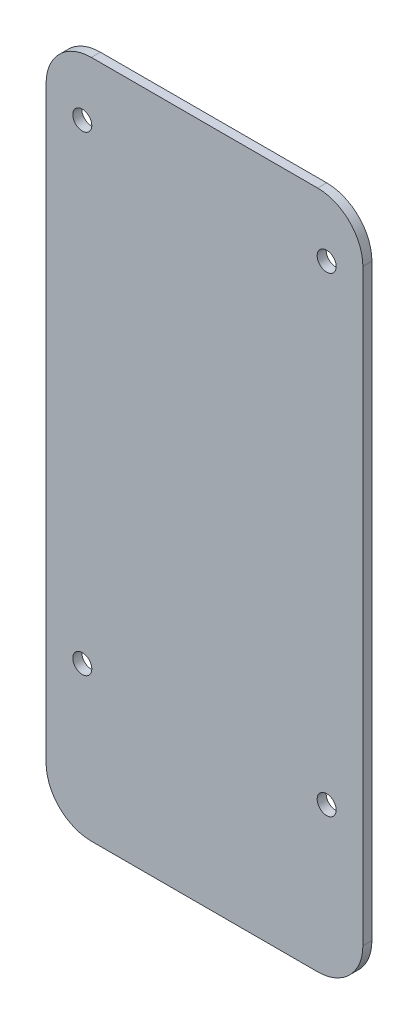
ISO-10303-21;
HEADER;
FILE_DESCRIPTION(('STEP AP214'),'2;1');
FILE_NAME('part.step','',(''),(''),'','','');
FILE_SCHEMA(('AUTOMOTIVE_DESIGN { 1 0 10303 214 1 1 1 1 }'));
ENDSEC;
DATA;
#1=APPLICATION_CONTEXT('core data for automotive mechanical design processes');
#2=APPLICATION_PROTOCOL_DEFINITION('international standard','automotive_design',2000,#1);
#3=PRODUCT_CONTEXT('',#1,'mechanical');
#4=PRODUCT('Part','Part','',(#3));
#5=PRODUCT_RELATED_PRODUCT_CATEGORY('part','',(#4));
#6=PRODUCT_DEFINITION_FORMATION('','',#4);
#7=PRODUCT_DEFINITION_CONTEXT('part definition',#1,'design');
#8=PRODUCT_DEFINITION('design','',#6,#7);
#9=PRODUCT_DEFINITION_SHAPE('','',#8);
#10=(LENGTH_UNIT() NAMED_UNIT(*) SI_UNIT(.MILLI.,.METRE.));
#11=(NAMED_UNIT(*) PLANE_ANGLE_UNIT() SI_UNIT($,.RADIAN.));
#12=(NAMED_UNIT(*) SI_UNIT($,.STERADIAN.) SOLID_ANGLE_UNIT());
#13=UNCERTAINTY_MEASURE_WITH_UNIT(LENGTH_MEASURE(1.E-05),#10,'distance_accuracy_value','');
#14=(GEOMETRIC_REPRESENTATION_CONTEXT(3) GLOBAL_UNCERTAINTY_ASSIGNED_CONTEXT((#13)) GLOBAL_UNIT_ASSIGNED_CONTEXT((#10,
#11,#12)) REPRESENTATION_CONTEXT('',''));
#15=CARTESIAN_POINT('',(0.,0.,0.));
#16=DIRECTION('',(0.,0.,1.));
#17=DIRECTION('',(1.,0.,0.));
#18=AXIS2_PLACEMENT_3D('',#15,#16,#17);
#19=CARTESIAN_POINT('',(0.,0.,2.));
#20=DIRECTION('',(0.,0.,1.));
#21=DIRECTION('',(1.,0.,0.));
#22=AXIS2_PLACEMENT_3D('',#19,#20,#21);
#23=PLANE('',#22);
#24=CARTESIAN_POINT('',(27.,-42.,2.));
#25=DIRECTION('',(0.,0.,1.));
#26=DIRECTION('',(1.,0.,0.));
#27=AXIS2_PLACEMENT_3D('',#24,#25,#26);
#28=CIRCLE('',#27,2.1);
#29=CARTESIAN_POINT('',(29.1,-42.,2.));
#30=VERTEX_POINT('',#29);
#31=EDGE_CURVE('E192',#30,#30,#28,.T.);
#32=ORIENTED_EDGE('',*,*,#31,.F.);
#33=EDGE_LOOP('',(#32));
#34=FACE_BOUND('',#33,.T.);
#35=CARTESIAN_POINT('',(-27.,62.,2.));
#36=DIRECTION('',(0.,0.,1.));
#37=DIRECTION('',(1.,0.,0.));
#38=AXIS2_PLACEMENT_3D('',#35,#36,#37);
#39=CIRCLE('',#38,2.1);
#40=CARTESIAN_POINT('',(-24.9,62.,2.));
#41=VERTEX_POINT('',#40);
#42=EDGE_CURVE('E133',#41,#41,#39,.T.);
#43=ORIENTED_EDGE('',*,*,#42,.F.);
#44=EDGE_LOOP('',(#43));
#45=FACE_BOUND('',#44,.T.);
#46=DIRECTION('',(1.,0.,0.));
#47=VECTOR('',#46,1.);
#48=CARTESIAN_POINT('',(-35.,-75.,2.));
#49=LINE('',#48,#47);
#50=CARTESIAN_POINT('',(-25.,-75.,2.));
#51=VERTEX_POINT('',#50);
#52=CARTESIAN_POINT('',(25.,-75.,2.));
#53=VERTEX_POINT('',#52);
#54=EDGE_CURVE('E142',#51,#53,#49,.T.);
#55=ORIENTED_EDGE('',*,*,#54,.T.);
#56=CARTESIAN_POINT('',(25.,-65.,2.));
#57=DIRECTION('',(0.,0.,1.));
#58=DIRECTION('',(1.,0.,0.));
#59=AXIS2_PLACEMENT_3D('',#56,#57,#58);
#60=CIRCLE('',#59,10.);
#61=CARTESIAN_POINT('',(35.,-65.,2.));
#62=VERTEX_POINT('',#61);
#63=EDGE_CURVE('E161',#53,#62,#60,.T.);
#64=ORIENTED_EDGE('',*,*,#63,.T.);
#65=DIRECTION('',(0.,1.,0.));
#66=VECTOR('',#65,1.);
#67=CARTESIAN_POINT('',(35.,75.,2.));
#68=LINE('',#67,#66);
#69=CARTESIAN_POINT('',(35.,65.,2.));
#70=VERTEX_POINT('',#69);
#71=EDGE_CURVE('E125',#62,#70,#68,.T.);
#72=ORIENTED_EDGE('',*,*,#71,.T.);
#73=CARTESIAN_POINT('',(25.,65.,2.));
#74=DIRECTION('',(0.,0.,1.));
#75=DIRECTION('',(1.,0.,0.));
#76=AXIS2_PLACEMENT_3D('',#73,#74,#75);
#77=CIRCLE('',#76,10.);
#78=CARTESIAN_POINT('',(25.,75.,2.));
#79=VERTEX_POINT('',#78);
#80=EDGE_CURVE('E156',#70,#79,#77,.T.);
#81=ORIENTED_EDGE('',*,*,#80,.T.);
#82=DIRECTION('',(-1.,0.,0.));
#83=VECTOR('',#82,1.);
#84=CARTESIAN_POINT('',(-35.,75.,2.));
#85=LINE('',#84,#83);
#86=CARTESIAN_POINT('',(-25.,75.,2.));
#87=VERTEX_POINT('',#86);
#88=EDGE_CURVE('E172',#79,#87,#85,.T.);
#89=ORIENTED_EDGE('',*,*,#88,.T.);
#90=CARTESIAN_POINT('',(-25.,65.,2.));
#91=DIRECTION('',(0.,0.,1.));
#92=DIRECTION('',(1.,0.,0.));
#93=AXIS2_PLACEMENT_3D('',#90,#91,#92);
#94=CIRCLE('',#93,10.);
#95=CARTESIAN_POINT('',(-35.,65.,2.));
#96=VERTEX_POINT('',#95);
#97=EDGE_CURVE('E61',#87,#96,#94,.T.);
#98=ORIENTED_EDGE('',*,*,#97,.T.);
#99=DIRECTION('',(0.,-1.,0.));
#100=VECTOR('',#99,1.);
#101=CARTESIAN_POINT('',(-35.,75.,2.));
#102=LINE('',#101,#100);
#103=CARTESIAN_POINT('',(-35.,-65.,2.));
#104=VERTEX_POINT('',#103);
#105=EDGE_CURVE('E180',#96,#104,#102,.T.);
#106=ORIENTED_EDGE('',*,*,#105,.T.);
#107=CARTESIAN_POINT('',(-25.,-65.,2.));
#108=DIRECTION('',(0.,0.,1.));
#109=DIRECTION('',(1.,0.,0.));
#110=AXIS2_PLACEMENT_3D('',#107,#108,#109);
#111=CIRCLE('',#110,10.);
#112=EDGE_CURVE('E159',#104,#51,#111,.T.);
#113=ORIENTED_EDGE('',*,*,#112,.T.);
#114=EDGE_LOOP('',(#55,#64,#72,#81,#89,#98,#106,#113));
#115=FACE_BOUND('',#114,.T.);
#116=CARTESIAN_POINT('',(27.,62.,2.));
#117=DIRECTION('',(0.,0.,1.));
#118=DIRECTION('',(-1.,0.,0.));
#119=AXIS2_PLACEMENT_3D('',#116,#117,#118);
#120=CIRCLE('',#119,2.1);
#121=CARTESIAN_POINT('',(24.9,62.,2.));
#122=VERTEX_POINT('',#121);
#123=EDGE_CURVE('E187',#122,#122,#120,.T.);
#124=ORIENTED_EDGE('',*,*,#123,.F.);
#125=EDGE_LOOP('',(#124));
#126=FACE_BOUND('',#125,.T.);
#127=CARTESIAN_POINT('',(-27.,-42.,2.));
#128=DIRECTION('',(0.,0.,1.));
#129=DIRECTION('',(-1.,0.,0.));
#130=AXIS2_PLACEMENT_3D('',#127,#128,#129);
#131=CIRCLE('',#130,2.1);
#132=CARTESIAN_POINT('',(-29.1,-42.,2.));
#133=VERTEX_POINT('',#132);
#134=EDGE_CURVE('E198',#133,#133,#131,.T.);
#135=ORIENTED_EDGE('',*,*,#134,.F.);
#136=EDGE_LOOP('',(#135));
#137=FACE_BOUND('',#136,.T.);
#138=ADVANCED_FACE('F39',(#34,#45,#115,#126,#137),#23,.T.);
#139=CARTESIAN_POINT('',(0.,0.,0.));
#140=DIRECTION('',(0.,0.,1.));
#141=DIRECTION('',(1.,0.,0.));
#142=AXIS2_PLACEMENT_3D('',#139,#140,#141);
#143=PLANE('',#142);
#144=DIRECTION('',(0.,1.,0.));
#145=VECTOR('',#144,1.);
#146=CARTESIAN_POINT('',(35.,75.,0.));
#147=LINE('',#146,#145);
#148=CARTESIAN_POINT('',(35.,-65.,0.));
#149=VERTEX_POINT('',#148);
#150=CARTESIAN_POINT('',(35.,65.,0.));
#151=VERTEX_POINT('',#150);
#152=EDGE_CURVE('E122',#149,#151,#147,.T.);
#153=ORIENTED_EDGE('',*,*,#152,.F.);
#154=CARTESIAN_POINT('',(25.,-65.,0.));
#155=DIRECTION('',(0.,0.,1.));
#156=DIRECTION('',(1.,0.,0.));
#157=AXIS2_PLACEMENT_3D('',#154,#155,#156);
#158=CIRCLE('',#157,10.);
#159=CARTESIAN_POINT('',(25.,-75.,0.));
#160=VERTEX_POINT('',#159);
#161=EDGE_CURVE('E105',#149,#160,#158,.F.);
#162=ORIENTED_EDGE('',*,*,#161,.T.);
#163=DIRECTION('',(1.,0.,0.));
#164=VECTOR('',#163,1.);
#165=CARTESIAN_POINT('',(-35.,-75.,0.));
#166=LINE('',#165,#164);
#167=CARTESIAN_POINT('',(-25.,-75.,0.));
#168=VERTEX_POINT('',#167);
#169=EDGE_CURVE('E146',#168,#160,#166,.T.);
#170=ORIENTED_EDGE('',*,*,#169,.F.);
#171=CARTESIAN_POINT('',(-25.,-65.,0.));
#172=DIRECTION('',(0.,0.,1.));
#173=DIRECTION('',(1.,0.,0.));
#174=AXIS2_PLACEMENT_3D('',#171,#172,#173);
#175=CIRCLE('',#174,10.);
#176=CARTESIAN_POINT('',(-35.,-65.,0.));
#177=VERTEX_POINT('',#176);
#178=EDGE_CURVE('E116',#168,#177,#175,.F.);
#179=ORIENTED_EDGE('',*,*,#178,.T.);
#180=DIRECTION('',(0.,-1.,0.));
#181=VECTOR('',#180,1.);
#182=CARTESIAN_POINT('',(-35.,75.,0.));
#183=LINE('',#182,#181);
#184=CARTESIAN_POINT('',(-35.,65.,0.));
#185=VERTEX_POINT('',#184);
#186=EDGE_CURVE('E136',#185,#177,#183,.T.);
#187=ORIENTED_EDGE('',*,*,#186,.F.);
#188=CARTESIAN_POINT('',(-25.,65.,0.));
#189=DIRECTION('',(0.,0.,1.));
#190=DIRECTION('',(1.,0.,0.));
#191=AXIS2_PLACEMENT_3D('',#188,#189,#190);
#192=CIRCLE('',#191,10.);
#193=CARTESIAN_POINT('',(-25.,75.,0.));
#194=VERTEX_POINT('',#193);
#195=EDGE_CURVE('E150',#185,#194,#192,.F.);
#196=ORIENTED_EDGE('',*,*,#195,.T.);
#197=DIRECTION('',(-1.,0.,0.));
#198=VECTOR('',#197,1.);
#199=CARTESIAN_POINT('',(-35.,75.,0.));
#200=LINE('',#199,#198);
#201=CARTESIAN_POINT('',(25.,75.,0.));
#202=VERTEX_POINT('',#201);
#203=EDGE_CURVE('E132',#202,#194,#200,.T.);
#204=ORIENTED_EDGE('',*,*,#203,.F.);
#205=CARTESIAN_POINT('',(25.,65.,0.));
#206=DIRECTION('',(0.,0.,1.));
#207=DIRECTION('',(1.,0.,0.));
#208=AXIS2_PLACEMENT_3D('',#205,#206,#207);
#209=CIRCLE('',#208,10.);
#210=EDGE_CURVE('E126',#202,#151,#209,.F.);
#211=ORIENTED_EDGE('',*,*,#210,.T.);
#212=EDGE_LOOP('',(#153,#162,#170,#179,#187,#196,#204,#211));
#213=FACE_BOUND('',#212,.T.);
#214=CARTESIAN_POINT('',(-27.,62.,0.));
#215=DIRECTION('',(0.,0.,1.));
#216=DIRECTION('',(1.,0.,0.));
#217=AXIS2_PLACEMENT_3D('',#214,#215,#216);
#218=CIRCLE('',#217,2.1);
#219=CARTESIAN_POINT('',(-24.9,62.,0.));
#220=VERTEX_POINT('',#219);
#221=EDGE_CURVE('E139',#220,#220,#218,.T.);
#222=ORIENTED_EDGE('',*,*,#221,.T.);
#223=EDGE_LOOP('',(#222));
#224=FACE_BOUND('',#223,.T.);
#225=CARTESIAN_POINT('',(27.,62.,0.));
#226=DIRECTION('',(0.,0.,1.));
#227=DIRECTION('',(-1.,0.,0.));
#228=AXIS2_PLACEMENT_3D('',#225,#226,#227);
#229=CIRCLE('',#228,2.1);
#230=CARTESIAN_POINT('',(24.9,62.,0.));
#231=VERTEX_POINT('',#230);
#232=EDGE_CURVE('E189',#231,#231,#229,.T.);
#233=ORIENTED_EDGE('',*,*,#232,.T.);
#234=EDGE_LOOP('',(#233));
#235=FACE_BOUND('',#234,.T.);
#236=CARTESIAN_POINT('',(27.,-42.,0.));
#237=DIRECTION('',(0.,0.,1.));
#238=DIRECTION('',(1.,0.,0.));
#239=AXIS2_PLACEMENT_3D('',#236,#237,#238);
#240=CIRCLE('',#239,2.1);
#241=CARTESIAN_POINT('',(29.1,-42.,0.));
#242=VERTEX_POINT('',#241);
#243=EDGE_CURVE('E195',#242,#242,#240,.T.);
#244=ORIENTED_EDGE('',*,*,#243,.T.);
#245=EDGE_LOOP('',(#244));
#246=FACE_BOUND('',#245,.T.);
#247=CARTESIAN_POINT('',(-27.,-42.,0.));
#248=DIRECTION('',(0.,0.,1.));
#249=DIRECTION('',(-1.,0.,0.));
#250=AXIS2_PLACEMENT_3D('',#247,#248,#249);
#251=CIRCLE('',#250,2.1);
#252=CARTESIAN_POINT('',(-29.1,-42.,0.));
#253=VERTEX_POINT('',#252);
#254=EDGE_CURVE('E201',#253,#253,#251,.T.);
#255=ORIENTED_EDGE('',*,*,#254,.T.);
#256=EDGE_LOOP('',(#255));
#257=FACE_BOUND('',#256,.T.);
#258=ADVANCED_FACE('F129',(#213,#224,#235,#246,#257),#143,.F.);
#259=CARTESIAN_POINT('',(35.,75.,2.));
#260=DIRECTION('',(-1.,0.,0.));
#261=DIRECTION('',(0.,0.,1.));
#262=AXIS2_PLACEMENT_3D('',#259,#260,#261);
#263=PLANE('',#262);
#264=ORIENTED_EDGE('',*,*,#71,.F.);
#265=DIRECTION('',(0.,0.,-1.));
#266=VECTOR('',#265,1.);
#267=CARTESIAN_POINT('',(35.,-65.,2.));
#268=LINE('',#267,#266);
#269=EDGE_CURVE('E109',#62,#149,#268,.T.);
#270=ORIENTED_EDGE('',*,*,#269,.T.);
#271=ORIENTED_EDGE('',*,*,#152,.T.);
#272=DIRECTION('',(0.,0.,-1.));
#273=VECTOR('',#272,1.);
#274=CARTESIAN_POINT('',(35.,65.,2.));
#275=LINE('',#274,#273);
#276=EDGE_CURVE('E127',#151,#70,#275,.F.);
#277=ORIENTED_EDGE('',*,*,#276,.T.);
#278=EDGE_LOOP('',(#264,#270,#271,#277));
#279=FACE_BOUND('',#278,.T.);
#280=ADVANCED_FACE('F121',(#279),#263,.F.);
#281=CARTESIAN_POINT('',(-35.,75.,2.));
#282=DIRECTION('',(0.,-1.,0.));
#283=DIRECTION('',(0.,0.,-1.));
#284=AXIS2_PLACEMENT_3D('',#281,#282,#283);
#285=PLANE('',#284);
#286=ORIENTED_EDGE('',*,*,#203,.T.);
#287=DIRECTION('',(0.,0.,-1.));
#288=VECTOR('',#287,1.);
#289=CARTESIAN_POINT('',(-25.,75.,2.));
#290=LINE('',#289,#288);
#291=EDGE_CURVE('E11',#194,#87,#290,.F.);
#292=ORIENTED_EDGE('',*,*,#291,.T.);
#293=ORIENTED_EDGE('',*,*,#88,.F.);
#294=DIRECTION('',(0.,0.,-1.));
#295=VECTOR('',#294,1.);
#296=CARTESIAN_POINT('',(25.,75.,2.));
#297=LINE('',#296,#295);
#298=EDGE_CURVE('E47',#79,#202,#297,.T.);
#299=ORIENTED_EDGE('',*,*,#298,.T.);
#300=EDGE_LOOP('',(#286,#292,#293,#299));
#301=FACE_BOUND('',#300,.T.);
#302=ADVANCED_FACE('F170',(#301),#285,.F.);
#303=CARTESIAN_POINT('',(-35.,75.,2.));
#304=DIRECTION('',(1.,0.,0.));
#305=DIRECTION('',(0.,0.,-1.));
#306=AXIS2_PLACEMENT_3D('',#303,#304,#305);
#307=PLANE('',#306);
#308=ORIENTED_EDGE('',*,*,#186,.T.);
#309=DIRECTION('',(0.,0.,-1.));
#310=VECTOR('',#309,1.);
#311=CARTESIAN_POINT('',(-35.,-65.,2.));
#312=LINE('',#311,#310);
#313=EDGE_CURVE('E54',#177,#104,#312,.F.);
#314=ORIENTED_EDGE('',*,*,#313,.T.);
#315=ORIENTED_EDGE('',*,*,#105,.F.);
#316=DIRECTION('',(0.,0.,-1.));
#317=VECTOR('',#316,1.);
#318=CARTESIAN_POINT('',(-35.,65.,2.));
#319=LINE('',#318,#317);
#320=EDGE_CURVE('E163',#96,#185,#319,.T.);
#321=ORIENTED_EDGE('',*,*,#320,.T.);
#322=EDGE_LOOP('',(#308,#314,#315,#321));
#323=FACE_BOUND('',#322,.T.);
#324=ADVANCED_FACE('F179',(#323),#307,.F.);
#325=CARTESIAN_POINT('',(-35.,-75.,2.));
#326=DIRECTION('',(0.,1.,0.));
#327=DIRECTION('',(0.,0.,1.));
#328=AXIS2_PLACEMENT_3D('',#325,#326,#327);
#329=PLANE('',#328);
#330=ORIENTED_EDGE('',*,*,#169,.T.);
#331=DIRECTION('',(0.,0.,-1.));
#332=VECTOR('',#331,1.);
#333=CARTESIAN_POINT('',(25.,-75.,2.));
#334=LINE('',#333,#332);
#335=EDGE_CURVE('E110',#160,#53,#334,.F.);
#336=ORIENTED_EDGE('',*,*,#335,.T.);
#337=ORIENTED_EDGE('',*,*,#54,.F.);
#338=DIRECTION('',(0.,0.,-1.));
#339=VECTOR('',#338,1.);
#340=CARTESIAN_POINT('',(-25.,-75.,2.));
#341=LINE('',#340,#339);
#342=EDGE_CURVE('E115',#51,#168,#341,.T.);
#343=ORIENTED_EDGE('',*,*,#342,.T.);
#344=EDGE_LOOP('',(#330,#336,#337,#343));
#345=FACE_BOUND('',#344,.T.);
#346=ADVANCED_FACE('F223',(#345),#329,.F.);
#347=CARTESIAN_POINT('',(-27.,62.,2.));
#348=DIRECTION('',(0.,0.,-1.));
#349=DIRECTION('',(-1.,0.,0.));
#350=AXIS2_PLACEMENT_3D('',#347,#348,#349);
#351=CYLINDRICAL_SURFACE('',#350,2.1);
#352=ORIENTED_EDGE('',*,*,#42,.T.);
#353=EDGE_LOOP('',(#352));
#354=FACE_BOUND('',#353,.T.);
#355=ORIENTED_EDGE('',*,*,#221,.F.);
#356=EDGE_LOOP('',(#355));
#357=FACE_BOUND('',#356,.T.);
#358=ADVANCED_FACE('F220',(#354,#357),#351,.F.);
#359=CARTESIAN_POINT('',(27.,62.,2.));
#360=DIRECTION('',(0.,0.,-1.));
#361=DIRECTION('',(-1.,0.,0.));
#362=AXIS2_PLACEMENT_3D('',#359,#360,#361);
#363=CYLINDRICAL_SURFACE('',#362,2.1);
#364=ORIENTED_EDGE('',*,*,#123,.T.);
#365=EDGE_LOOP('',(#364));
#366=FACE_BOUND('',#365,.T.);
#367=ORIENTED_EDGE('',*,*,#232,.F.);
#368=EDGE_LOOP('',(#367));
#369=FACE_BOUND('',#368,.T.);
#370=ADVANCED_FACE('F249',(#366,#369),#363,.F.);
#371=CARTESIAN_POINT('',(27.,-42.,2.));
#372=DIRECTION('',(0.,0.,-1.));
#373=DIRECTION('',(-1.,0.,0.));
#374=AXIS2_PLACEMENT_3D('',#371,#372,#373);
#375=CYLINDRICAL_SURFACE('',#374,2.1);
#376=ORIENTED_EDGE('',*,*,#31,.T.);
#377=EDGE_LOOP('',(#376));
#378=FACE_BOUND('',#377,.T.);
#379=ORIENTED_EDGE('',*,*,#243,.F.);
#380=EDGE_LOOP('',(#379));
#381=FACE_BOUND('',#380,.T.);
#382=ADVANCED_FACE('F252',(#378,#381),#375,.F.);
#383=CARTESIAN_POINT('',(-27.,-42.,2.));
#384=DIRECTION('',(0.,0.,-1.));
#385=DIRECTION('',(-1.,0.,0.));
#386=AXIS2_PLACEMENT_3D('',#383,#384,#385);
#387=CYLINDRICAL_SURFACE('',#386,2.1);
#388=ORIENTED_EDGE('',*,*,#134,.T.);
#389=EDGE_LOOP('',(#388));
#390=FACE_BOUND('',#389,.T.);
#391=ORIENTED_EDGE('',*,*,#254,.F.);
#392=EDGE_LOOP('',(#391));
#393=FACE_BOUND('',#392,.T.);
#394=ADVANCED_FACE('F207',(#390,#393),#387,.F.);
#395=CARTESIAN_POINT('',(25.,-65.,2.));
#396=DIRECTION('',(0.,0.,-1.));
#397=DIRECTION('',(-1.,0.,0.));
#398=AXIS2_PLACEMENT_3D('',#395,#396,#397);
#399=CYLINDRICAL_SURFACE('',#398,10.);
#400=ORIENTED_EDGE('',*,*,#63,.F.);
#401=ORIENTED_EDGE('',*,*,#335,.F.);
#402=ORIENTED_EDGE('',*,*,#161,.F.);
#403=ORIENTED_EDGE('',*,*,#269,.F.);
#404=EDGE_LOOP('',(#400,#401,#402,#403));
#405=FACE_BOUND('',#404,.T.);
#406=ADVANCED_FACE('F108',(#405),#399,.T.);
#407=CARTESIAN_POINT('',(-25.,-65.,2.));
#408=DIRECTION('',(0.,0.,-1.));
#409=DIRECTION('',(-1.,0.,0.));
#410=AXIS2_PLACEMENT_3D('',#407,#408,#409);
#411=CYLINDRICAL_SURFACE('',#410,10.);
#412=ORIENTED_EDGE('',*,*,#112,.F.);
#413=ORIENTED_EDGE('',*,*,#313,.F.);
#414=ORIENTED_EDGE('',*,*,#178,.F.);
#415=ORIENTED_EDGE('',*,*,#342,.F.);
#416=EDGE_LOOP('',(#412,#413,#414,#415));
#417=FACE_BOUND('',#416,.T.);
#418=ADVANCED_FACE('F235',(#417),#411,.T.);
#419=CARTESIAN_POINT('',(-25.,65.,2.));
#420=DIRECTION('',(0.,0.,-1.));
#421=DIRECTION('',(-1.,0.,0.));
#422=AXIS2_PLACEMENT_3D('',#419,#420,#421);
#423=CYLINDRICAL_SURFACE('',#422,10.);
#424=ORIENTED_EDGE('',*,*,#97,.F.);
#425=ORIENTED_EDGE('',*,*,#291,.F.);
#426=ORIENTED_EDGE('',*,*,#195,.F.);
#427=ORIENTED_EDGE('',*,*,#320,.F.);
#428=EDGE_LOOP('',(#424,#425,#426,#427));
#429=FACE_BOUND('',#428,.T.);
#430=ADVANCED_FACE('F178',(#429),#423,.T.);
#431=CARTESIAN_POINT('',(25.,65.,2.));
#432=DIRECTION('',(0.,0.,-1.));
#433=DIRECTION('',(-1.,0.,0.));
#434=AXIS2_PLACEMENT_3D('',#431,#432,#433);
#435=CYLINDRICAL_SURFACE('',#434,10.);
#436=ORIENTED_EDGE('',*,*,#80,.F.);
#437=ORIENTED_EDGE('',*,*,#276,.F.);
#438=ORIENTED_EDGE('',*,*,#210,.F.);
#439=ORIENTED_EDGE('',*,*,#298,.F.);
#440=EDGE_LOOP('',(#436,#437,#438,#439));
#441=FACE_BOUND('',#440,.T.);
#442=ADVANCED_FACE('F41',(#441),#435,.T.);
#443=CLOSED_SHELL('',(#138,#258,#280,#302,#324,#346,#358,#370,#382,#394,#406,#418,#430,#442));
#444=MANIFOLD_SOLID_BREP('B2',#443);
#445=ADVANCED_BREP_SHAPE_REPRESENTATION('',(#18,#444),#14);
#446=SHAPE_DEFINITION_REPRESENTATION(#9,#445);
ENDSEC;
END-ISO-10303-21;
